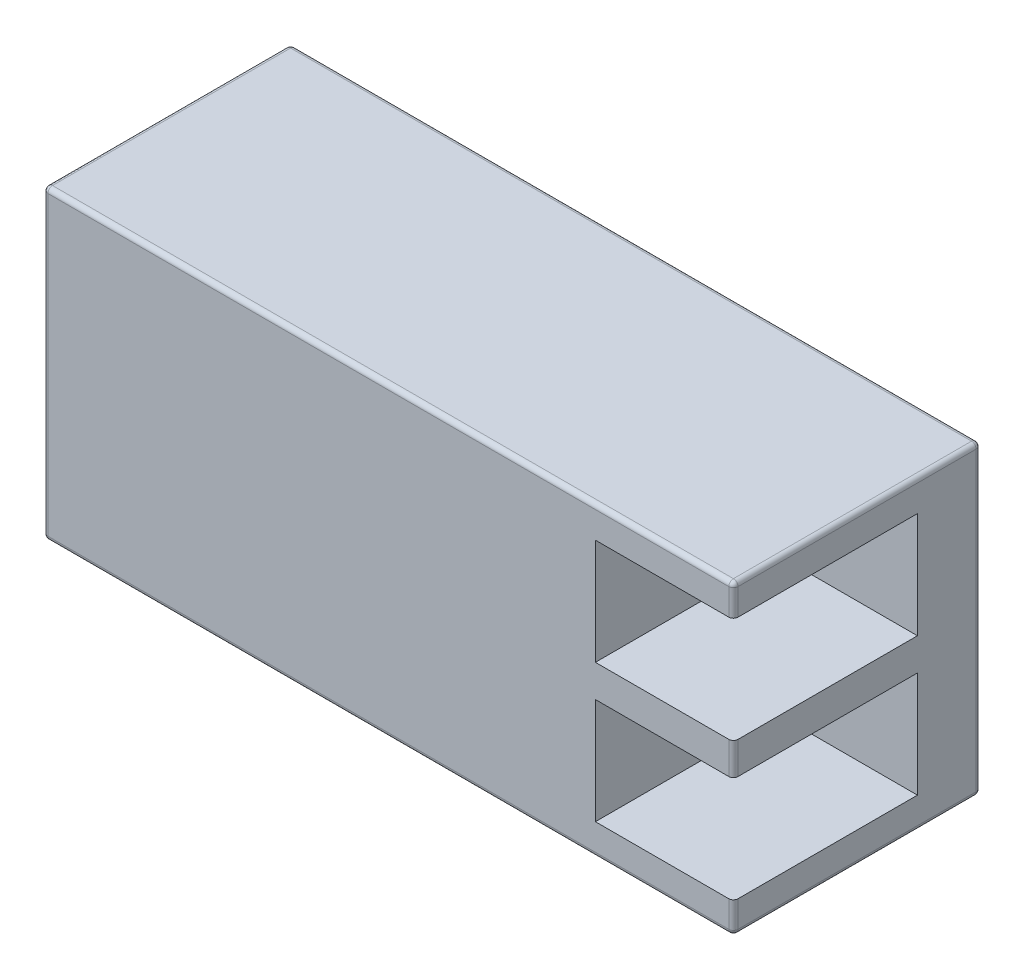
ISO-10303-21;
HEADER;
FILE_DESCRIPTION(('STEP AP214'),'2;1');
FILE_NAME('part.step','',(''),(''),'','','');
FILE_SCHEMA(('AUTOMOTIVE_DESIGN { 1 0 10303 214 1 1 1 1 }'));
ENDSEC;
DATA;
#1=APPLICATION_CONTEXT('core data for automotive mechanical design processes');
#2=APPLICATION_PROTOCOL_DEFINITION('international standard','automotive_design',2000,#1);
#3=PRODUCT_CONTEXT('',#1,'mechanical');
#4=PRODUCT('Part','Part','',(#3));
#5=PRODUCT_RELATED_PRODUCT_CATEGORY('part','',(#4));
#6=PRODUCT_DEFINITION_FORMATION('','',#4);
#7=PRODUCT_DEFINITION_CONTEXT('part definition',#1,'design');
#8=PRODUCT_DEFINITION('design','',#6,#7);
#9=PRODUCT_DEFINITION_SHAPE('','',#8);
#10=(LENGTH_UNIT() NAMED_UNIT(*) SI_UNIT(.MILLI.,.METRE.));
#11=(NAMED_UNIT(*) PLANE_ANGLE_UNIT() SI_UNIT($,.RADIAN.));
#12=(NAMED_UNIT(*) SI_UNIT($,.STERADIAN.) SOLID_ANGLE_UNIT());
#13=UNCERTAINTY_MEASURE_WITH_UNIT(LENGTH_MEASURE(1.E-05),#10,'distance_accuracy_value','');
#14=(GEOMETRIC_REPRESENTATION_CONTEXT(3) GLOBAL_UNCERTAINTY_ASSIGNED_CONTEXT((#13)) GLOBAL_UNIT_ASSIGNED_CONTEXT((#10,
#11,#12)) REPRESENTATION_CONTEXT('',''));
#15=CARTESIAN_POINT('',(0.,0.,0.));
#16=DIRECTION('',(0.,0.,1.));
#17=DIRECTION('',(1.,0.,0.));
#18=AXIS2_PLACEMENT_3D('',#15,#16,#17);
#19=CARTESIAN_POINT('',(15.,6.65,10.75));
#20=DIRECTION('',(-1.,0.,0.));
#21=DIRECTION('',(0.,0.,1.));
#22=AXIS2_PLACEMENT_3D('',#19,#20,#21);
#23=PLANE('',#22);
#24=DIRECTION('',(0.,0.,-1.));
#25=VECTOR('',#24,1.);
#26=CARTESIAN_POINT('',(15.,0.699999999999995,10.75));
#27=LINE('',#26,#25);
#28=CARTESIAN_POINT('',(15.,0.699999999999995,10.55));
#29=VERTEX_POINT('',#28);
#30=CARTESIAN_POINT('',(15.,0.699999999999995,2.75));
#31=VERTEX_POINT('',#30);
#32=EDGE_CURVE('E236',#29,#31,#27,.T.);
#33=ORIENTED_EDGE('',*,*,#32,.F.);
#34=DIRECTION('',(0.,1.,0.));
#35=VECTOR('',#34,1.);
#36=CARTESIAN_POINT('',(15.,6.65,10.55));
#37=LINE('',#36,#35);
#38=CARTESIAN_POINT('',(15.,-0.7,10.55));
#39=VERTEX_POINT('',#38);
#40=EDGE_CURVE('E277',#29,#39,#37,.F.);
#41=ORIENTED_EDGE('',*,*,#40,.T.);
#42=DIRECTION('',(0.,0.,1.));
#43=VECTOR('',#42,1.);
#44=CARTESIAN_POINT('',(15.,-0.7,10.75));
#45=LINE('',#44,#43);
#46=CARTESIAN_POINT('',(15.,-0.7,2.75));
#47=VERTEX_POINT('',#46);
#48=EDGE_CURVE('E208',#47,#39,#45,.T.);
#49=ORIENTED_EDGE('',*,*,#48,.F.);
#50=DIRECTION('',(0.,1.,0.));
#51=VECTOR('',#50,1.);
#52=CARTESIAN_POINT('',(15.,-0.7,2.75));
#53=LINE('',#52,#51);
#54=CARTESIAN_POINT('',(15.,-5.3,2.75));
#55=VERTEX_POINT('',#54);
#56=EDGE_CURVE('E397',#55,#47,#53,.T.);
#57=ORIENTED_EDGE('',*,*,#56,.F.);
#58=DIRECTION('',(0.,0.,-1.));
#59=VECTOR('',#58,1.);
#60=CARTESIAN_POINT('',(15.,-5.3,10.75));
#61=LINE('',#60,#59);
#62=CARTESIAN_POINT('',(15.,-5.3,10.55));
#63=VERTEX_POINT('',#62);
#64=EDGE_CURVE('E238',#63,#55,#61,.T.);
#65=ORIENTED_EDGE('',*,*,#64,.F.);
#66=DIRECTION('',(0.,1.,0.));
#67=VECTOR('',#66,1.);
#68=CARTESIAN_POINT('',(15.,6.65,10.55));
#69=LINE('',#68,#67);
#70=CARTESIAN_POINT('',(15.,-6.45,10.55));
#71=VERTEX_POINT('',#70);
#72=EDGE_CURVE('E275',#63,#71,#69,.F.);
#73=ORIENTED_EDGE('',*,*,#72,.T.);
#74=DIRECTION('',(0.,0.,-1.));
#75=VECTOR('',#74,1.);
#76=CARTESIAN_POINT('',(15.,-6.45,10.75));
#77=LINE('',#76,#75);
#78=CARTESIAN_POINT('',(15.,-6.45,0.200000000000001));
#79=VERTEX_POINT('',#78);
#80=EDGE_CURVE('E266',#71,#79,#77,.T.);
#81=ORIENTED_EDGE('',*,*,#80,.T.);
#82=DIRECTION('',(0.,1.,0.));
#83=VECTOR('',#82,1.);
#84=CARTESIAN_POINT('',(15.,6.65,0.200000000000001));
#85=LINE('',#84,#83);
#86=CARTESIAN_POINT('',(15.,6.45,0.200000000000001));
#87=VERTEX_POINT('',#86);
#88=EDGE_CURVE('E268',#79,#87,#85,.T.);
#89=ORIENTED_EDGE('',*,*,#88,.T.);
#90=DIRECTION('',(0.,0.,-1.));
#91=VECTOR('',#90,1.);
#92=CARTESIAN_POINT('',(15.,6.45,10.75));
#93=LINE('',#92,#91);
#94=CARTESIAN_POINT('',(15.,6.45,10.55));
#95=VERTEX_POINT('',#94);
#96=EDGE_CURVE('E269',#87,#95,#93,.F.);
#97=ORIENTED_EDGE('',*,*,#96,.T.);
#98=DIRECTION('',(0.,1.,0.));
#99=VECTOR('',#98,1.);
#100=CARTESIAN_POINT('',(15.,6.65,10.55));
#101=LINE('',#100,#99);
#102=CARTESIAN_POINT('',(15.,5.29999999999999,10.55));
#103=VERTEX_POINT('',#102);
#104=EDGE_CURVE('E273',#95,#103,#101,.F.);
#105=ORIENTED_EDGE('',*,*,#104,.T.);
#106=DIRECTION('',(0.,0.,1.));
#107=VECTOR('',#106,1.);
#108=CARTESIAN_POINT('',(15.,5.29999999999999,10.75));
#109=LINE('',#108,#107);
#110=CARTESIAN_POINT('',(15.,5.29999999999999,2.75));
#111=VERTEX_POINT('',#110);
#112=EDGE_CURVE('E231',#111,#103,#109,.T.);
#113=ORIENTED_EDGE('',*,*,#112,.F.);
#114=DIRECTION('',(0.,1.,0.));
#115=VECTOR('',#114,1.);
#116=CARTESIAN_POINT('',(15.,0.699999999999995,2.75));
#117=LINE('',#116,#115);
#118=EDGE_CURVE('E233',#31,#111,#117,.T.);
#119=ORIENTED_EDGE('',*,*,#118,.F.);
#120=EDGE_LOOP('',(#33,#41,#49,#57,#65,#73,#81,#89,#97,#105,#113,#119));
#121=FACE_BOUND('',#120,.T.);
#122=ADVANCED_FACE('F39',(#121),#23,.F.);
#123=CARTESIAN_POINT('',(-15.,6.65,10.75));
#124=DIRECTION('',(1.,0.,0.));
#125=DIRECTION('',(0.,0.,-1.));
#126=AXIS2_PLACEMENT_3D('',#123,#124,#125);
#127=PLANE('',#126);
#128=DIRECTION('',(0.,-1.,0.));
#129=VECTOR('',#128,1.);
#130=CARTESIAN_POINT('',(-15.,-6.65,0.200000000000001));
#131=LINE('',#130,#129);
#132=CARTESIAN_POINT('',(-15.,6.45,0.200000000000001));
#133=VERTEX_POINT('',#132);
#134=CARTESIAN_POINT('',(-15.,-6.45000000000001,0.200000000000001));
#135=VERTEX_POINT('',#134);
#136=EDGE_CURVE('E299',#133,#135,#131,.T.);
#137=ORIENTED_EDGE('',*,*,#136,.T.);
#138=DIRECTION('',(0.,0.,-1.));
#139=VECTOR('',#138,1.);
#140=CARTESIAN_POINT('',(-15.,-6.45000000000001,10.75));
#141=LINE('',#140,#139);
#142=CARTESIAN_POINT('',(-15.,-6.45000000000001,10.55));
#143=VERTEX_POINT('',#142);
#144=EDGE_CURVE('E300',#135,#143,#141,.F.);
#145=ORIENTED_EDGE('',*,*,#144,.T.);
#146=DIRECTION('',(0.,-1.,0.));
#147=VECTOR('',#146,1.);
#148=CARTESIAN_POINT('',(-15.,6.65,10.55));
#149=LINE('',#148,#147);
#150=CARTESIAN_POINT('',(-15.,6.45,10.55));
#151=VERTEX_POINT('',#150);
#152=EDGE_CURVE('E291',#143,#151,#149,.F.);
#153=ORIENTED_EDGE('',*,*,#152,.T.);
#154=DIRECTION('',(0.,0.,-1.));
#155=VECTOR('',#154,1.);
#156=CARTESIAN_POINT('',(-15.,6.45,10.75));
#157=LINE('',#156,#155);
#158=EDGE_CURVE('E293',#151,#133,#157,.T.);
#159=ORIENTED_EDGE('',*,*,#158,.T.);
#160=EDGE_LOOP('',(#137,#145,#153,#159));
#161=FACE_BOUND('',#160,.T.);
#162=ADVANCED_FACE('F487',(#161),#127,.F.);
#163=CARTESIAN_POINT('',(15.,-6.65,10.75));
#164=DIRECTION('',(0.,1.,0.));
#165=DIRECTION('',(-1.,0.,0.));
#166=AXIS2_PLACEMENT_3D('',#163,#164,#165);
#167=PLANE('',#166);
#168=DIRECTION('',(1.,0.,0.));
#169=VECTOR('',#168,1.);
#170=CARTESIAN_POINT('',(15.,-6.65,10.55));
#171=LINE('',#170,#169);
#172=CARTESIAN_POINT('',(14.8,-6.65,10.55));
#173=VERTEX_POINT('',#172);
#174=CARTESIAN_POINT('',(-14.8,-6.65,10.55));
#175=VERTEX_POINT('',#174);
#176=EDGE_CURVE('E285',#173,#175,#171,.F.);
#177=ORIENTED_EDGE('',*,*,#176,.T.);
#178=DIRECTION('',(0.,0.,-1.));
#179=VECTOR('',#178,1.);
#180=CARTESIAN_POINT('',(-14.8,-6.65,10.75));
#181=LINE('',#180,#179);
#182=CARTESIAN_POINT('',(-14.8,-6.65,0.200000000000001));
#183=VERTEX_POINT('',#182);
#184=EDGE_CURVE('E289',#175,#183,#181,.T.);
#185=ORIENTED_EDGE('',*,*,#184,.T.);
#186=DIRECTION('',(1.,0.,0.));
#187=VECTOR('',#186,1.);
#188=CARTESIAN_POINT('',(15.,-6.65,0.200000000000001));
#189=LINE('',#188,#187);
#190=CARTESIAN_POINT('',(14.8,-6.65,0.200000000000001));
#191=VERTEX_POINT('',#190);
#192=EDGE_CURVE('E287',#183,#191,#189,.T.);
#193=ORIENTED_EDGE('',*,*,#192,.T.);
#194=DIRECTION('',(0.,0.,-1.));
#195=VECTOR('',#194,1.);
#196=CARTESIAN_POINT('',(14.8,-6.65,10.75));
#197=LINE('',#196,#195);
#198=EDGE_CURVE('E286',#191,#173,#197,.F.);
#199=ORIENTED_EDGE('',*,*,#198,.T.);
#200=EDGE_LOOP('',(#177,#185,#193,#199));
#201=FACE_BOUND('',#200,.T.);
#202=ADVANCED_FACE('F494',(#201),#167,.F.);
#203=CARTESIAN_POINT('',(15.,6.65,10.75));
#204=DIRECTION('',(0.,-1.,0.));
#205=DIRECTION('',(1.,0.,0.));
#206=AXIS2_PLACEMENT_3D('',#203,#204,#205);
#207=PLANE('',#206);
#208=DIRECTION('',(0.,0.,-1.));
#209=VECTOR('',#208,1.);
#210=CARTESIAN_POINT('',(14.8,6.65,10.75));
#211=LINE('',#210,#209);
#212=CARTESIAN_POINT('',(14.8,6.65,10.55));
#213=VERTEX_POINT('',#212);
#214=CARTESIAN_POINT('',(14.8,6.65,0.200000000000001));
#215=VERTEX_POINT('',#214);
#216=EDGE_CURVE('E56',#213,#215,#211,.T.);
#217=ORIENTED_EDGE('',*,*,#216,.T.);
#218=DIRECTION('',(-1.,0.,0.));
#219=VECTOR('',#218,1.);
#220=CARTESIAN_POINT('',(-15.,6.65,0.200000000000001));
#221=LINE('',#220,#219);
#222=CARTESIAN_POINT('',(-14.8,6.65,0.200000000000001));
#223=VERTEX_POINT('',#222);
#224=EDGE_CURVE('E11',#215,#223,#221,.T.);
#225=ORIENTED_EDGE('',*,*,#224,.T.);
#226=DIRECTION('',(0.,0.,-1.));
#227=VECTOR('',#226,1.);
#228=CARTESIAN_POINT('',(-14.8,6.65,10.75));
#229=LINE('',#228,#227);
#230=CARTESIAN_POINT('',(-14.8,6.65,10.55));
#231=VERTEX_POINT('',#230);
#232=EDGE_CURVE('E48',#223,#231,#229,.F.);
#233=ORIENTED_EDGE('',*,*,#232,.T.);
#234=DIRECTION('',(-1.,0.,0.));
#235=VECTOR('',#234,1.);
#236=CARTESIAN_POINT('',(15.,6.65,10.55));
#237=LINE('',#236,#235);
#238=EDGE_CURVE('E313',#231,#213,#237,.F.);
#239=ORIENTED_EDGE('',*,*,#238,.T.);
#240=EDGE_LOOP('',(#217,#225,#233,#239));
#241=FACE_BOUND('',#240,.T.);
#242=ADVANCED_FACE('F451',(#241),#207,.F.);
#243=CARTESIAN_POINT('',(0.,0.,10.75));
#244=DIRECTION('',(0.,0.,-1.));
#245=DIRECTION('',(-1.,0.,0.));
#246=AXIS2_PLACEMENT_3D('',#243,#244,#245);
#247=PLANE('',#246);
#248=DIRECTION('',(1.,0.,0.));
#249=VECTOR('',#248,1.);
#250=CARTESIAN_POINT('',(9.,-0.7,10.75));
#251=LINE('',#250,#249);
#252=CARTESIAN_POINT('',(9.,-0.7,10.75));
#253=VERTEX_POINT('',#252);
#254=CARTESIAN_POINT('',(14.8,-0.7,10.75));
#255=VERTEX_POINT('',#254);
#256=EDGE_CURVE('E251',#253,#255,#251,.T.);
#257=ORIENTED_EDGE('',*,*,#256,.T.);
#258=DIRECTION('',(0.,1.,0.));
#259=VECTOR('',#258,1.);
#260=CARTESIAN_POINT('',(14.8,0.,10.75));
#261=LINE('',#260,#259);
#262=CARTESIAN_POINT('',(14.8,0.699999999999995,10.75));
#263=VERTEX_POINT('',#262);
#264=EDGE_CURVE('E261',#255,#263,#261,.T.);
#265=ORIENTED_EDGE('',*,*,#264,.T.);
#266=DIRECTION('',(1.,0.,0.));
#267=VECTOR('',#266,1.);
#268=CARTESIAN_POINT('',(9.,0.699999999999995,10.75));
#269=LINE('',#268,#267);
#270=CARTESIAN_POINT('',(9.,0.699999999999995,10.75));
#271=VERTEX_POINT('',#270);
#272=EDGE_CURVE('E227',#271,#263,#269,.T.);
#273=ORIENTED_EDGE('',*,*,#272,.F.);
#274=DIRECTION('',(0.,-1.,0.));
#275=VECTOR('',#274,1.);
#276=CARTESIAN_POINT('',(9.,0.699999999999995,10.75));
#277=LINE('',#276,#275);
#278=CARTESIAN_POINT('',(9.,5.29999999999999,10.75));
#279=VERTEX_POINT('',#278);
#280=EDGE_CURVE('E225',#279,#271,#277,.T.);
#281=ORIENTED_EDGE('',*,*,#280,.F.);
#282=DIRECTION('',(1.,0.,0.));
#283=VECTOR('',#282,1.);
#284=CARTESIAN_POINT('',(9.,5.29999999999999,10.75));
#285=LINE('',#284,#283);
#286=CARTESIAN_POINT('',(14.8,5.29999999999999,10.75));
#287=VERTEX_POINT('',#286);
#288=EDGE_CURVE('E223',#279,#287,#285,.T.);
#289=ORIENTED_EDGE('',*,*,#288,.T.);
#290=DIRECTION('',(0.,1.,0.));
#291=VECTOR('',#290,1.);
#292=CARTESIAN_POINT('',(14.8,0.,10.75));
#293=LINE('',#292,#291);
#294=CARTESIAN_POINT('',(14.8,6.45,10.75));
#295=VERTEX_POINT('',#294);
#296=EDGE_CURVE('E256',#287,#295,#293,.T.);
#297=ORIENTED_EDGE('',*,*,#296,.T.);
#298=DIRECTION('',(-1.,0.,0.));
#299=VECTOR('',#298,1.);
#300=CARTESIAN_POINT('',(0.,6.45,10.75));
#301=LINE('',#300,#299);
#302=CARTESIAN_POINT('',(-14.8,6.45,10.75));
#303=VERTEX_POINT('',#302);
#304=EDGE_CURVE('E254',#295,#303,#301,.T.);
#305=ORIENTED_EDGE('',*,*,#304,.T.);
#306=DIRECTION('',(0.,-1.,0.));
#307=VECTOR('',#306,1.);
#308=CARTESIAN_POINT('',(-14.8,0.,10.75));
#309=LINE('',#308,#307);
#310=CARTESIAN_POINT('',(-14.8,-6.45000000000001,10.75));
#311=VERTEX_POINT('',#310);
#312=EDGE_CURVE('E252',#303,#311,#309,.T.);
#313=ORIENTED_EDGE('',*,*,#312,.T.);
#314=DIRECTION('',(1.,0.,0.));
#315=VECTOR('',#314,1.);
#316=CARTESIAN_POINT('',(0.,-6.45,10.75));
#317=LINE('',#316,#315);
#318=CARTESIAN_POINT('',(14.8,-6.45,10.75));
#319=VERTEX_POINT('',#318);
#320=EDGE_CURVE('E249',#311,#319,#317,.T.);
#321=ORIENTED_EDGE('',*,*,#320,.T.);
#322=DIRECTION('',(0.,1.,0.));
#323=VECTOR('',#322,1.);
#324=CARTESIAN_POINT('',(14.8,0.,10.75));
#325=LINE('',#324,#323);
#326=CARTESIAN_POINT('',(14.8,-5.3,10.75));
#327=VERTEX_POINT('',#326);
#328=EDGE_CURVE('E215',#319,#327,#325,.T.);
#329=ORIENTED_EDGE('',*,*,#328,.T.);
#330=DIRECTION('',(1.,0.,0.));
#331=VECTOR('',#330,1.);
#332=CARTESIAN_POINT('',(9.,-5.3,10.75));
#333=LINE('',#332,#331);
#334=CARTESIAN_POINT('',(9.,-5.3,10.75));
#335=VERTEX_POINT('',#334);
#336=EDGE_CURVE('E191',#335,#327,#333,.T.);
#337=ORIENTED_EDGE('',*,*,#336,.F.);
#338=DIRECTION('',(0.,-1.,0.));
#339=VECTOR('',#338,1.);
#340=CARTESIAN_POINT('',(9.,-0.7,10.75));
#341=LINE('',#340,#339);
#342=EDGE_CURVE('E200',#253,#335,#341,.T.);
#343=ORIENTED_EDGE('',*,*,#342,.F.);
#344=EDGE_LOOP('',(#257,#265,#273,#281,#289,#297,#305,#313,#321,#329,#337,#343));
#345=FACE_BOUND('',#344,.T.);
#346=ADVANCED_FACE('F209',(#345),#247,.F.);
#347=CARTESIAN_POINT('',(0.,0.,0.));
#348=DIRECTION('',(0.,0.,-1.));
#349=DIRECTION('',(-1.,0.,0.));
#350=AXIS2_PLACEMENT_3D('',#347,#348,#349);
#351=PLANE('',#350);
#352=DIRECTION('',(1.,0.,0.));
#353=VECTOR('',#352,1.);
#354=CARTESIAN_POINT('',(-15.,-6.45000000000001,0.));
#355=LINE('',#354,#353);
#356=CARTESIAN_POINT('',(14.8,-6.45,0.));
#357=VERTEX_POINT('',#356);
#358=CARTESIAN_POINT('',(-14.8,-6.45000000000001,0.));
#359=VERTEX_POINT('',#358);
#360=EDGE_CURVE('E303',#357,#359,#355,.F.);
#361=ORIENTED_EDGE('',*,*,#360,.T.);
#362=DIRECTION('',(0.,-1.,0.));
#363=VECTOR('',#362,1.);
#364=CARTESIAN_POINT('',(-14.8,6.65,0.));
#365=LINE('',#364,#363);
#366=CARTESIAN_POINT('',(-14.8,6.45,0.));
#367=VERTEX_POINT('',#366);
#368=EDGE_CURVE('E306',#359,#367,#365,.F.);
#369=ORIENTED_EDGE('',*,*,#368,.T.);
#370=DIRECTION('',(-1.,0.,0.));
#371=VECTOR('',#370,1.);
#372=CARTESIAN_POINT('',(15.,6.45,0.));
#373=LINE('',#372,#371);
#374=CARTESIAN_POINT('',(14.8,6.45,0.));
#375=VERTEX_POINT('',#374);
#376=EDGE_CURVE('E308',#367,#375,#373,.F.);
#377=ORIENTED_EDGE('',*,*,#376,.T.);
#378=DIRECTION('',(0.,1.,0.));
#379=VECTOR('',#378,1.);
#380=CARTESIAN_POINT('',(14.8,-6.65,0.));
#381=LINE('',#380,#379);
#382=EDGE_CURVE('E305',#375,#357,#381,.F.);
#383=ORIENTED_EDGE('',*,*,#382,.T.);
#384=EDGE_LOOP('',(#361,#369,#377,#383));
#385=FACE_BOUND('',#384,.T.);
#386=ADVANCED_FACE('F472',(#385),#351,.T.);
#387=CARTESIAN_POINT('',(9.,0.699999999999995,10.75));
#388=DIRECTION('',(0.,-1.,0.));
#389=DIRECTION('',(0.,0.,-1.));
#390=AXIS2_PLACEMENT_3D('',#387,#388,#389);
#391=PLANE('',#390);
#392=ORIENTED_EDGE('',*,*,#272,.T.);
#393=CARTESIAN_POINT('',(14.8,0.699999999999995,10.55));
#394=DIRECTION('',(0.,-1.,0.));
#395=DIRECTION('',(0.,0.,-1.));
#396=AXIS2_PLACEMENT_3D('',#393,#394,#395);
#397=CIRCLE('',#396,0.2);
#398=EDGE_CURVE('E262',#263,#29,#397,.F.);
#399=ORIENTED_EDGE('',*,*,#398,.T.);
#400=ORIENTED_EDGE('',*,*,#32,.T.);
#401=DIRECTION('',(1.,0.,0.));
#402=VECTOR('',#401,1.);
#403=CARTESIAN_POINT('',(9.,0.699999999999995,2.75));
#404=LINE('',#403,#402);
#405=CARTESIAN_POINT('',(9.,0.699999999999995,2.75));
#406=VERTEX_POINT('',#405);
#407=EDGE_CURVE('E218',#406,#31,#404,.T.);
#408=ORIENTED_EDGE('',*,*,#407,.F.);
#409=DIRECTION('',(0.,0.,-1.));
#410=VECTOR('',#409,1.);
#411=CARTESIAN_POINT('',(9.,0.699999999999995,10.75));
#412=LINE('',#411,#410);
#413=EDGE_CURVE('E234',#271,#406,#412,.T.);
#414=ORIENTED_EDGE('',*,*,#413,.F.);
#415=EDGE_LOOP('',(#392,#399,#400,#408,#414));
#416=FACE_BOUND('',#415,.T.);
#417=ADVANCED_FACE('F416',(#416),#391,.F.);
#418=CARTESIAN_POINT('',(9.,5.29999999999999,10.75));
#419=DIRECTION('',(0.,1.,0.));
#420=DIRECTION('',(0.,0.,1.));
#421=AXIS2_PLACEMENT_3D('',#418,#419,#420);
#422=PLANE('',#421);
#423=ORIENTED_EDGE('',*,*,#112,.T.);
#424=CARTESIAN_POINT('',(14.8,5.29999999999999,10.55));
#425=DIRECTION('',(0.,1.,0.));
#426=DIRECTION('',(0.,0.,1.));
#427=AXIS2_PLACEMENT_3D('',#424,#425,#426);
#428=CIRCLE('',#427,0.2);
#429=EDGE_CURVE('E278',#103,#287,#428,.F.);
#430=ORIENTED_EDGE('',*,*,#429,.T.);
#431=ORIENTED_EDGE('',*,*,#288,.F.);
#432=DIRECTION('',(0.,0.,1.));
#433=VECTOR('',#432,1.);
#434=CARTESIAN_POINT('',(9.,5.29999999999999,10.75));
#435=LINE('',#434,#433);
#436=CARTESIAN_POINT('',(9.,5.29999999999999,2.75));
#437=VERTEX_POINT('',#436);
#438=EDGE_CURVE('E242',#437,#279,#435,.T.);
#439=ORIENTED_EDGE('',*,*,#438,.F.);
#440=DIRECTION('',(1.,0.,0.));
#441=VECTOR('',#440,1.);
#442=CARTESIAN_POINT('',(9.,5.29999999999999,2.75));
#443=LINE('',#442,#441);
#444=EDGE_CURVE('E224',#437,#111,#443,.T.);
#445=ORIENTED_EDGE('',*,*,#444,.T.);
#446=EDGE_LOOP('',(#423,#430,#431,#439,#445));
#447=FACE_BOUND('',#446,.T.);
#448=ADVANCED_FACE('F718',(#447),#422,.F.);
#449=CARTESIAN_POINT('',(9.,0.699999999999995,2.75));
#450=DIRECTION('',(0.,0.,-1.));
#451=DIRECTION('',(-1.,0.,0.));
#452=AXIS2_PLACEMENT_3D('',#449,#450,#451);
#453=PLANE('',#452);
#454=ORIENTED_EDGE('',*,*,#118,.T.);
#455=ORIENTED_EDGE('',*,*,#444,.F.);
#456=DIRECTION('',(0.,1.,0.));
#457=VECTOR('',#456,1.);
#458=CARTESIAN_POINT('',(9.,0.699999999999995,2.75));
#459=LINE('',#458,#457);
#460=EDGE_CURVE('E241',#406,#437,#459,.T.);
#461=ORIENTED_EDGE('',*,*,#460,.F.);
#462=ORIENTED_EDGE('',*,*,#407,.T.);
#463=EDGE_LOOP('',(#454,#455,#461,#462));
#464=FACE_BOUND('',#463,.T.);
#465=ADVANCED_FACE('F715',(#464),#453,.F.);
#466=CARTESIAN_POINT('',(9.,0.,0.));
#467=DIRECTION('',(1.,0.,0.));
#468=DIRECTION('',(0.,0.,-1.));
#469=AXIS2_PLACEMENT_3D('',#466,#467,#468);
#470=PLANE('',#469);
#471=ORIENTED_EDGE('',*,*,#413,.T.);
#472=ORIENTED_EDGE('',*,*,#460,.T.);
#473=ORIENTED_EDGE('',*,*,#438,.T.);
#474=ORIENTED_EDGE('',*,*,#280,.T.);
#475=EDGE_LOOP('',(#471,#472,#473,#474));
#476=FACE_BOUND('',#475,.T.);
#477=ADVANCED_FACE('F423',(#476),#470,.T.);
#478=CARTESIAN_POINT('',(9.,-0.7,10.75));
#479=DIRECTION('',(0.,1.,0.));
#480=DIRECTION('',(0.,0.,1.));
#481=AXIS2_PLACEMENT_3D('',#478,#479,#480);
#482=PLANE('',#481);
#483=ORIENTED_EDGE('',*,*,#48,.T.);
#484=CARTESIAN_POINT('',(14.8,-0.7,10.55));
#485=DIRECTION('',(0.,1.,0.));
#486=DIRECTION('',(0.,0.,1.));
#487=AXIS2_PLACEMENT_3D('',#484,#485,#486);
#488=CIRCLE('',#487,0.2);
#489=EDGE_CURVE('E279',#39,#255,#488,.F.);
#490=ORIENTED_EDGE('',*,*,#489,.T.);
#491=ORIENTED_EDGE('',*,*,#256,.F.);
#492=DIRECTION('',(0.,0.,1.));
#493=VECTOR('',#492,1.);
#494=CARTESIAN_POINT('',(9.,-0.7,10.75));
#495=LINE('',#494,#493);
#496=CARTESIAN_POINT('',(9.,-0.7,2.75));
#497=VERTEX_POINT('',#496);
#498=EDGE_CURVE('E204',#497,#253,#495,.T.);
#499=ORIENTED_EDGE('',*,*,#498,.F.);
#500=DIRECTION('',(1.,0.,0.));
#501=VECTOR('',#500,1.);
#502=CARTESIAN_POINT('',(9.,-0.7,2.75));
#503=LINE('',#502,#501);
#504=EDGE_CURVE('E212',#497,#47,#503,.T.);
#505=ORIENTED_EDGE('',*,*,#504,.T.);
#506=EDGE_LOOP('',(#483,#490,#491,#499,#505));
#507=FACE_BOUND('',#506,.T.);
#508=ADVANCED_FACE('F408',(#507),#482,.F.);
#509=CARTESIAN_POINT('',(9.,-0.7,2.75));
#510=DIRECTION('',(0.,0.,-1.));
#511=DIRECTION('',(-1.,0.,0.));
#512=AXIS2_PLACEMENT_3D('',#509,#510,#511);
#513=PLANE('',#512);
#514=ORIENTED_EDGE('',*,*,#56,.T.);
#515=ORIENTED_EDGE('',*,*,#504,.F.);
#516=DIRECTION('',(0.,1.,0.));
#517=VECTOR('',#516,1.);
#518=CARTESIAN_POINT('',(9.,-0.7,2.75));
#519=LINE('',#518,#517);
#520=CARTESIAN_POINT('',(9.,-5.3,2.75));
#521=VERTEX_POINT('',#520);
#522=EDGE_CURVE('E196',#521,#497,#519,.T.);
#523=ORIENTED_EDGE('',*,*,#522,.F.);
#524=DIRECTION('',(1.,0.,0.));
#525=VECTOR('',#524,1.);
#526=CARTESIAN_POINT('',(9.,-5.3,2.75));
#527=LINE('',#526,#525);
#528=EDGE_CURVE('E193',#521,#55,#527,.T.);
#529=ORIENTED_EDGE('',*,*,#528,.T.);
#530=EDGE_LOOP('',(#514,#515,#523,#529));
#531=FACE_BOUND('',#530,.T.);
#532=ADVANCED_FACE('F410',(#531),#513,.F.);
#533=CARTESIAN_POINT('',(9.,-5.3,10.75));
#534=DIRECTION('',(0.,-1.,0.));
#535=DIRECTION('',(0.,0.,-1.));
#536=AXIS2_PLACEMENT_3D('',#533,#534,#535);
#537=PLANE('',#536);
#538=ORIENTED_EDGE('',*,*,#336,.T.);
#539=CARTESIAN_POINT('',(14.8,-5.3,10.55));
#540=DIRECTION('',(0.,-1.,0.));
#541=DIRECTION('',(0.,0.,-1.));
#542=AXIS2_PLACEMENT_3D('',#539,#540,#541);
#543=CIRCLE('',#542,0.2);
#544=EDGE_CURVE('E284',#327,#63,#543,.F.);
#545=ORIENTED_EDGE('',*,*,#544,.T.);
#546=ORIENTED_EDGE('',*,*,#64,.T.);
#547=ORIENTED_EDGE('',*,*,#528,.F.);
#548=DIRECTION('',(0.,0.,-1.));
#549=VECTOR('',#548,1.);
#550=CARTESIAN_POINT('',(9.,-5.3,10.75));
#551=LINE('',#550,#549);
#552=EDGE_CURVE('E189',#335,#521,#551,.T.);
#553=ORIENTED_EDGE('',*,*,#552,.F.);
#554=EDGE_LOOP('',(#538,#545,#546,#547,#553));
#555=FACE_BOUND('',#554,.T.);
#556=ADVANCED_FACE('F190',(#555),#537,.F.);
#557=CARTESIAN_POINT('',(9.,0.,0.));
#558=DIRECTION('',(1.,0.,0.));
#559=DIRECTION('',(0.,0.,-1.));
#560=AXIS2_PLACEMENT_3D('',#557,#558,#559);
#561=PLANE('',#560);
#562=ORIENTED_EDGE('',*,*,#342,.T.);
#563=ORIENTED_EDGE('',*,*,#552,.T.);
#564=ORIENTED_EDGE('',*,*,#522,.T.);
#565=ORIENTED_EDGE('',*,*,#498,.T.);
#566=EDGE_LOOP('',(#562,#563,#564,#565));
#567=FACE_BOUND('',#566,.T.);
#568=ADVANCED_FACE('F205',(#567),#561,.T.);
#569=CARTESIAN_POINT('',(14.8,0.,10.55));
#570=DIRECTION('',(0.,1.,0.));
#571=DIRECTION('',(0.,0.,1.));
#572=AXIS2_PLACEMENT_3D('',#569,#570,#571);
#573=CYLINDRICAL_SURFACE('',#572,0.2);
#574=ORIENTED_EDGE('',*,*,#489,.F.);
#575=ORIENTED_EDGE('',*,*,#40,.F.);
#576=ORIENTED_EDGE('',*,*,#398,.F.);
#577=ORIENTED_EDGE('',*,*,#264,.F.);
#578=EDGE_LOOP('',(#574,#575,#576,#577));
#579=FACE_BOUND('',#578,.T.);
#580=ADVANCED_FACE('F412',(#579),#573,.T.);
#581=CARTESIAN_POINT('',(-14.8,-6.45000000000001,0.2));
#582=DIRECTION('',(-1.,0.,0.));
#583=DIRECTION('',(0.,0.,1.));
#584=AXIS2_PLACEMENT_3D('',#581,#582,#583);
#585=SPHERICAL_SURFACE('',#584,0.2);
#586=CARTESIAN_POINT('',(-14.8,-6.45000000000001,0.2));
#587=DIRECTION('',(-1.,0.,0.));
#588=DIRECTION('',(0.,0.,1.));
#589=AXIS2_PLACEMENT_3D('',#586,#587,#588);
#590=CIRCLE('',#589,0.2);
#591=EDGE_CURVE('E367',#183,#359,#590,.F.);
#592=ORIENTED_EDGE('',*,*,#591,.F.);
#593=CARTESIAN_POINT('',(-14.8,-6.45000000000001,0.200000000000001));
#594=DIRECTION('',(0.,0.,-1.));
#595=DIRECTION('',(-1.,0.,0.));
#596=AXIS2_PLACEMENT_3D('',#593,#594,#595);
#597=CIRCLE('',#596,0.2);
#598=EDGE_CURVE('E376',#135,#183,#597,.F.);
#599=ORIENTED_EDGE('',*,*,#598,.F.);
#600=CARTESIAN_POINT('',(-14.8,-6.45000000000001,0.200000000000001));
#601=DIRECTION('',(0.,-1.,0.));
#602=DIRECTION('',(0.,0.,-1.));
#603=AXIS2_PLACEMENT_3D('',#600,#601,#602);
#604=CIRCLE('',#603,0.2);
#605=EDGE_CURVE('E373',#359,#135,#604,.F.);
#606=ORIENTED_EDGE('',*,*,#605,.F.);
#607=EDGE_LOOP('',(#592,#599,#606));
#608=FACE_BOUND('',#607,.T.);
#609=ADVANCED_FACE('F485',(#608),#585,.T.);
#610=CARTESIAN_POINT('',(14.8,0.,10.55));
#611=DIRECTION('',(0.,1.,0.));
#612=DIRECTION('',(0.,0.,1.));
#613=AXIS2_PLACEMENT_3D('',#610,#611,#612);
#614=CYLINDRICAL_SURFACE('',#613,0.2);
#615=CARTESIAN_POINT('',(14.8,-6.45,10.55));
#616=DIRECTION('',(0.,-1.,0.));
#617=DIRECTION('',(0.,0.,-1.));
#618=AXIS2_PLACEMENT_3D('',#615,#616,#617);
#619=CIRCLE('',#618,0.2);
#620=EDGE_CURVE('E43',#71,#319,#619,.T.);
#621=ORIENTED_EDGE('',*,*,#620,.F.);
#622=ORIENTED_EDGE('',*,*,#72,.F.);
#623=ORIENTED_EDGE('',*,*,#544,.F.);
#624=ORIENTED_EDGE('',*,*,#328,.F.);
#625=EDGE_LOOP('',(#621,#622,#623,#624));
#626=FACE_BOUND('',#625,.T.);
#627=ADVANCED_FACE('F41',(#626),#614,.T.);
#628=CARTESIAN_POINT('',(14.8,-6.45,10.55));
#629=DIRECTION('',(0.,0.,1.));
#630=DIRECTION('',(1.,0.,0.));
#631=AXIS2_PLACEMENT_3D('',#628,#629,#630);
#632=SPHERICAL_SURFACE('',#631,0.2);
#633=CARTESIAN_POINT('',(14.8,-6.45,10.55));
#634=DIRECTION('',(0.,0.,1.));
#635=DIRECTION('',(1.,0.,0.));
#636=AXIS2_PLACEMENT_3D('',#633,#634,#635);
#637=CIRCLE('',#636,0.2);
#638=EDGE_CURVE('E370',#71,#173,#637,.F.);
#639=ORIENTED_EDGE('',*,*,#638,.F.);
#640=ORIENTED_EDGE('',*,*,#620,.T.);
#641=CARTESIAN_POINT('',(14.8,-6.45,10.55));
#642=DIRECTION('',(1.,0.,0.));
#643=DIRECTION('',(0.,0.,-1.));
#644=AXIS2_PLACEMENT_3D('',#641,#642,#643);
#645=CIRCLE('',#644,0.2);
#646=EDGE_CURVE('E378',#173,#319,#645,.F.);
#647=ORIENTED_EDGE('',*,*,#646,.F.);
#648=EDGE_LOOP('',(#639,#640,#647));
#649=FACE_BOUND('',#648,.T.);
#650=ADVANCED_FACE('F389',(#649),#632,.T.);
#651=CARTESIAN_POINT('',(0.,-6.45,10.55));
#652=DIRECTION('',(1.,0.,0.));
#653=DIRECTION('',(0.,1.,0.));
#654=AXIS2_PLACEMENT_3D('',#651,#652,#653);
#655=CYLINDRICAL_SURFACE('',#654,0.2);
#656=ORIENTED_EDGE('',*,*,#646,.T.);
#657=ORIENTED_EDGE('',*,*,#320,.F.);
#658=CARTESIAN_POINT('',(-14.8,-6.45000000000001,10.55));
#659=DIRECTION('',(-1.,0.,0.));
#660=DIRECTION('',(0.,0.,1.));
#661=AXIS2_PLACEMENT_3D('',#658,#659,#660);
#662=CIRCLE('',#661,0.2);
#663=EDGE_CURVE('E365',#175,#311,#662,.T.);
#664=ORIENTED_EDGE('',*,*,#663,.F.);
#665=ORIENTED_EDGE('',*,*,#176,.F.);
#666=EDGE_LOOP('',(#656,#657,#664,#665));
#667=FACE_BOUND('',#666,.T.);
#668=ADVANCED_FACE('F492',(#667),#655,.T.);
#669=CARTESIAN_POINT('',(-14.8,-6.45000000000001,10.75));
#670=DIRECTION('',(0.,0.,-1.));
#671=DIRECTION('',(-1.,0.,0.));
#672=AXIS2_PLACEMENT_3D('',#669,#670,#671);
#673=CYLINDRICAL_SURFACE('',#672,0.2);
#674=ORIENTED_EDGE('',*,*,#598,.T.);
#675=ORIENTED_EDGE('',*,*,#184,.F.);
#676=CARTESIAN_POINT('',(-14.8,-6.45000000000001,10.55));
#677=DIRECTION('',(0.,0.,1.));
#678=DIRECTION('',(1.,0.,0.));
#679=AXIS2_PLACEMENT_3D('',#676,#677,#678);
#680=CIRCLE('',#679,0.2);
#681=EDGE_CURVE('E363',#143,#175,#680,.T.);
#682=ORIENTED_EDGE('',*,*,#681,.F.);
#683=ORIENTED_EDGE('',*,*,#144,.F.);
#684=EDGE_LOOP('',(#674,#675,#682,#683));
#685=FACE_BOUND('',#684,.T.);
#686=ADVANCED_FACE('F490',(#685),#673,.T.);
#687=CARTESIAN_POINT('',(-14.8,6.65,0.200000000000001));
#688=DIRECTION('',(0.,1.,0.));
#689=DIRECTION('',(0.,0.,1.));
#690=AXIS2_PLACEMENT_3D('',#687,#688,#689);
#691=CYLINDRICAL_SURFACE('',#690,0.2);
#692=ORIENTED_EDGE('',*,*,#605,.T.);
#693=ORIENTED_EDGE('',*,*,#136,.F.);
#694=CARTESIAN_POINT('',(-14.8,6.45,0.2));
#695=DIRECTION('',(0.,1.,0.));
#696=DIRECTION('',(0.,0.,1.));
#697=AXIS2_PLACEMENT_3D('',#694,#695,#696);
#698=CIRCLE('',#697,0.2);
#699=EDGE_CURVE('E357',#367,#133,#698,.T.);
#700=ORIENTED_EDGE('',*,*,#699,.F.);
#701=ORIENTED_EDGE('',*,*,#368,.F.);
#702=EDGE_LOOP('',(#692,#693,#700,#701));
#703=FACE_BOUND('',#702,.T.);
#704=ADVANCED_FACE('F469',(#703),#691,.T.);
#705=CARTESIAN_POINT('',(15.,-6.45,0.200000000000001));
#706=DIRECTION('',(-1.,0.,0.));
#707=DIRECTION('',(0.,-1.,0.));
#708=AXIS2_PLACEMENT_3D('',#705,#706,#707);
#709=CYLINDRICAL_SURFACE('',#708,0.2);
#710=ORIENTED_EDGE('',*,*,#591,.T.);
#711=ORIENTED_EDGE('',*,*,#360,.F.);
#712=CARTESIAN_POINT('',(14.8,-6.45,0.200000000000001));
#713=DIRECTION('',(1.,0.,0.));
#714=DIRECTION('',(0.,0.,-1.));
#715=AXIS2_PLACEMENT_3D('',#712,#713,#714);
#716=CIRCLE('',#715,0.2);
#717=EDGE_CURVE('E351',#191,#357,#716,.T.);
#718=ORIENTED_EDGE('',*,*,#717,.F.);
#719=ORIENTED_EDGE('',*,*,#192,.F.);
#720=EDGE_LOOP('',(#710,#711,#718,#719));
#721=FACE_BOUND('',#720,.T.);
#722=ADVANCED_FACE('F479',(#721),#709,.T.);
#723=CARTESIAN_POINT('',(14.8,-6.45,10.75));
#724=DIRECTION('',(0.,0.,-1.));
#725=DIRECTION('',(-1.,0.,0.));
#726=AXIS2_PLACEMENT_3D('',#723,#724,#725);
#727=CYLINDRICAL_SURFACE('',#726,0.2);
#728=ORIENTED_EDGE('',*,*,#638,.T.);
#729=ORIENTED_EDGE('',*,*,#198,.F.);
#730=CARTESIAN_POINT('',(14.8,-6.45,0.200000000000001));
#731=DIRECTION('',(0.,0.,-1.));
#732=DIRECTION('',(-1.,0.,0.));
#733=AXIS2_PLACEMENT_3D('',#730,#731,#732);
#734=CIRCLE('',#733,0.2);
#735=EDGE_CURVE('E354',#79,#191,#734,.T.);
#736=ORIENTED_EDGE('',*,*,#735,.F.);
#737=ORIENTED_EDGE('',*,*,#80,.F.);
#738=EDGE_LOOP('',(#728,#729,#736,#737));
#739=FACE_BOUND('',#738,.T.);
#740=ADVANCED_FACE('F496',(#739),#727,.T.);
#741=CARTESIAN_POINT('',(-14.8,-6.45000000000001,10.55));
#742=DIRECTION('',(0.,-1.,0.));
#743=DIRECTION('',(0.,0.,-1.));
#744=AXIS2_PLACEMENT_3D('',#741,#742,#743);
#745=SPHERICAL_SURFACE('',#744,0.2);
#746=ORIENTED_EDGE('',*,*,#681,.T.);
#747=ORIENTED_EDGE('',*,*,#663,.T.);
#748=CARTESIAN_POINT('',(-14.8,-6.45000000000001,10.55));
#749=DIRECTION('',(0.,-1.,0.));
#750=DIRECTION('',(0.,0.,-1.));
#751=AXIS2_PLACEMENT_3D('',#748,#749,#750);
#752=CIRCLE('',#751,0.2);
#753=EDGE_CURVE('E349',#143,#311,#752,.F.);
#754=ORIENTED_EDGE('',*,*,#753,.F.);
#755=EDGE_LOOP('',(#746,#747,#754));
#756=FACE_BOUND('',#755,.T.);
#757=ADVANCED_FACE('F491',(#756),#745,.T.);
#758=CARTESIAN_POINT('',(-14.8,6.45,0.2));
#759=DIRECTION('',(-1.,0.,0.));
#760=DIRECTION('',(0.,0.,1.));
#761=AXIS2_PLACEMENT_3D('',#758,#759,#760);
#762=SPHERICAL_SURFACE('',#761,0.2);
#763=CARTESIAN_POINT('',(-14.8,6.45,0.200000000000001));
#764=DIRECTION('',(-1.,0.,0.));
#765=DIRECTION('',(0.,0.,1.));
#766=AXIS2_PLACEMENT_3D('',#763,#764,#765);
#767=CIRCLE('',#766,0.2);
#768=EDGE_CURVE('E343',#367,#223,#767,.F.);
#769=ORIENTED_EDGE('',*,*,#768,.F.);
#770=ORIENTED_EDGE('',*,*,#699,.T.);
#771=CARTESIAN_POINT('',(-14.8,6.45,0.200000000000001));
#772=DIRECTION('',(0.,0.,-1.));
#773=DIRECTION('',(-1.,0.,0.));
#774=AXIS2_PLACEMENT_3D('',#771,#772,#773);
#775=CIRCLE('',#774,0.2);
#776=EDGE_CURVE('E347',#223,#133,#775,.F.);
#777=ORIENTED_EDGE('',*,*,#776,.F.);
#778=EDGE_LOOP('',(#769,#770,#777));
#779=FACE_BOUND('',#778,.T.);
#780=ADVANCED_FACE('F466',(#779),#762,.T.);
#781=CARTESIAN_POINT('',(14.8,-6.45,0.2));
#782=DIRECTION('',(0.,-1.,0.));
#783=DIRECTION('',(0.,0.,-1.));
#784=AXIS2_PLACEMENT_3D('',#781,#782,#783);
#785=SPHERICAL_SURFACE('',#784,0.2);
#786=ORIENTED_EDGE('',*,*,#735,.T.);
#787=ORIENTED_EDGE('',*,*,#717,.T.);
#788=CARTESIAN_POINT('',(14.8,-6.45,0.2));
#789=DIRECTION('',(0.,-1.,0.));
#790=DIRECTION('',(1.,0.,0.));
#791=AXIS2_PLACEMENT_3D('',#788,#789,#790);
#792=CIRCLE('',#791,0.2);
#793=EDGE_CURVE('E341',#79,#357,#792,.F.);
#794=ORIENTED_EDGE('',*,*,#793,.F.);
#795=EDGE_LOOP('',(#786,#787,#794));
#796=FACE_BOUND('',#795,.T.);
#797=ADVANCED_FACE('F501',(#796),#785,.T.);
#798=CARTESIAN_POINT('',(-14.8,0.,10.55));
#799=DIRECTION('',(0.,-1.,0.));
#800=DIRECTION('',(0.,0.,-1.));
#801=AXIS2_PLACEMENT_3D('',#798,#799,#800);
#802=CYLINDRICAL_SURFACE('',#801,0.2);
#803=ORIENTED_EDGE('',*,*,#753,.T.);
#804=ORIENTED_EDGE('',*,*,#312,.F.);
#805=CARTESIAN_POINT('',(-14.8,6.45,10.55));
#806=DIRECTION('',(0.,1.,0.));
#807=DIRECTION('',(0.,0.,1.));
#808=AXIS2_PLACEMENT_3D('',#805,#806,#807);
#809=CIRCLE('',#808,0.2);
#810=EDGE_CURVE('E337',#151,#303,#809,.T.);
#811=ORIENTED_EDGE('',*,*,#810,.F.);
#812=ORIENTED_EDGE('',*,*,#152,.F.);
#813=EDGE_LOOP('',(#803,#804,#811,#812));
#814=FACE_BOUND('',#813,.T.);
#815=ADVANCED_FACE('F445',(#814),#802,.T.);
#816=CARTESIAN_POINT('',(-14.8,6.45,10.75));
#817=DIRECTION('',(0.,0.,-1.));
#818=DIRECTION('',(-1.,0.,0.));
#819=AXIS2_PLACEMENT_3D('',#816,#817,#818);
#820=CYLINDRICAL_SURFACE('',#819,0.2);
#821=ORIENTED_EDGE('',*,*,#776,.T.);
#822=ORIENTED_EDGE('',*,*,#158,.F.);
#823=CARTESIAN_POINT('',(-14.8,6.45,10.55));
#824=DIRECTION('',(0.,0.,1.));
#825=DIRECTION('',(1.,0.,0.));
#826=AXIS2_PLACEMENT_3D('',#823,#824,#825);
#827=CIRCLE('',#826,0.2);
#828=EDGE_CURVE('E333',#231,#151,#827,.T.);
#829=ORIENTED_EDGE('',*,*,#828,.F.);
#830=ORIENTED_EDGE('',*,*,#232,.F.);
#831=EDGE_LOOP('',(#821,#822,#829,#830));
#832=FACE_BOUND('',#831,.T.);
#833=ADVANCED_FACE('F446',(#832),#820,.T.);
#834=CARTESIAN_POINT('',(15.,6.45,0.200000000000001));
#835=DIRECTION('',(1.,0.,0.));
#836=DIRECTION('',(0.,1.,0.));
#837=AXIS2_PLACEMENT_3D('',#834,#835,#836);
#838=CYLINDRICAL_SURFACE('',#837,0.2);
#839=ORIENTED_EDGE('',*,*,#768,.T.);
#840=ORIENTED_EDGE('',*,*,#224,.F.);
#841=CARTESIAN_POINT('',(14.8,6.45,0.2));
#842=DIRECTION('',(1.,0.,0.));
#843=DIRECTION('',(0.,0.,-1.));
#844=AXIS2_PLACEMENT_3D('',#841,#842,#843);
#845=CIRCLE('',#844,0.2);
#846=EDGE_CURVE('E335',#375,#215,#845,.T.);
#847=ORIENTED_EDGE('',*,*,#846,.F.);
#848=ORIENTED_EDGE('',*,*,#376,.F.);
#849=EDGE_LOOP('',(#839,#840,#847,#848));
#850=FACE_BOUND('',#849,.T.);
#851=ADVANCED_FACE('F463',(#850),#838,.T.);
#852=CARTESIAN_POINT('',(14.8,6.65,0.200000000000001));
#853=DIRECTION('',(0.,-1.,0.));
#854=DIRECTION('',(0.,0.,-1.));
#855=AXIS2_PLACEMENT_3D('',#852,#853,#854);
#856=CYLINDRICAL_SURFACE('',#855,0.2);
#857=ORIENTED_EDGE('',*,*,#793,.T.);
#858=ORIENTED_EDGE('',*,*,#382,.F.);
#859=CARTESIAN_POINT('',(14.8,6.45,0.200000000000001));
#860=DIRECTION('',(0.,1.,0.));
#861=DIRECTION('',(0.,0.,1.));
#862=AXIS2_PLACEMENT_3D('',#859,#860,#861);
#863=CIRCLE('',#862,0.2);
#864=EDGE_CURVE('E328',#87,#375,#863,.T.);
#865=ORIENTED_EDGE('',*,*,#864,.F.);
#866=ORIENTED_EDGE('',*,*,#88,.F.);
#867=EDGE_LOOP('',(#857,#858,#865,#866));
#868=FACE_BOUND('',#867,.T.);
#869=ADVANCED_FACE('F502',(#868),#856,.T.);
#870=CARTESIAN_POINT('',(-14.8,6.45,10.55));
#871=DIRECTION('',(-1.,0.,0.));
#872=DIRECTION('',(0.,0.,1.));
#873=AXIS2_PLACEMENT_3D('',#870,#871,#872);
#874=SPHERICAL_SURFACE('',#873,0.2);
#875=ORIENTED_EDGE('',*,*,#828,.T.);
#876=ORIENTED_EDGE('',*,*,#810,.T.);
#877=CARTESIAN_POINT('',(-14.8,6.45,10.55));
#878=DIRECTION('',(-1.,0.,0.));
#879=DIRECTION('',(0.,0.,1.));
#880=AXIS2_PLACEMENT_3D('',#877,#878,#879);
#881=CIRCLE('',#880,0.2);
#882=EDGE_CURVE('E326',#231,#303,#881,.F.);
#883=ORIENTED_EDGE('',*,*,#882,.F.);
#884=EDGE_LOOP('',(#875,#876,#883));
#885=FACE_BOUND('',#884,.T.);
#886=ADVANCED_FACE('F443',(#885),#874,.T.);
#887=CARTESIAN_POINT('',(14.8,6.45,0.2));
#888=DIRECTION('',(0.,0.,-1.));
#889=DIRECTION('',(-1.,0.,0.));
#890=AXIS2_PLACEMENT_3D('',#887,#888,#889);
#891=SPHERICAL_SURFACE('',#890,0.2);
#892=ORIENTED_EDGE('',*,*,#864,.T.);
#893=ORIENTED_EDGE('',*,*,#846,.T.);
#894=CARTESIAN_POINT('',(14.8,6.45,0.200000000000001));
#895=DIRECTION('',(0.,0.,-1.));
#896=DIRECTION('',(-1.,0.,0.));
#897=AXIS2_PLACEMENT_3D('',#894,#895,#896);
#898=CIRCLE('',#897,0.2);
#899=EDGE_CURVE('E323',#87,#215,#898,.F.);
#900=ORIENTED_EDGE('',*,*,#899,.F.);
#901=EDGE_LOOP('',(#892,#893,#900));
#902=FACE_BOUND('',#901,.T.);
#903=ADVANCED_FACE('F460',(#902),#891,.T.);
#904=CARTESIAN_POINT('',(0.,6.45,10.55));
#905=DIRECTION('',(-1.,0.,0.));
#906=DIRECTION('',(0.,-1.,0.));
#907=AXIS2_PLACEMENT_3D('',#904,#905,#906);
#908=CYLINDRICAL_SURFACE('',#907,0.2);
#909=ORIENTED_EDGE('',*,*,#882,.T.);
#910=ORIENTED_EDGE('',*,*,#304,.F.);
#911=CARTESIAN_POINT('',(14.8,6.45,10.55));
#912=DIRECTION('',(1.,0.,0.));
#913=DIRECTION('',(0.,0.,-1.));
#914=AXIS2_PLACEMENT_3D('',#911,#912,#913);
#915=CIRCLE('',#914,0.2);
#916=EDGE_CURVE('E319',#213,#295,#915,.T.);
#917=ORIENTED_EDGE('',*,*,#916,.F.);
#918=ORIENTED_EDGE('',*,*,#238,.F.);
#919=EDGE_LOOP('',(#909,#910,#917,#918));
#920=FACE_BOUND('',#919,.T.);
#921=ADVANCED_FACE('F440',(#920),#908,.T.);
#922=CARTESIAN_POINT('',(14.8,6.45,10.75));
#923=DIRECTION('',(0.,0.,-1.));
#924=DIRECTION('',(-1.,0.,0.));
#925=AXIS2_PLACEMENT_3D('',#922,#923,#924);
#926=CYLINDRICAL_SURFACE('',#925,0.2);
#927=ORIENTED_EDGE('',*,*,#899,.T.);
#928=ORIENTED_EDGE('',*,*,#216,.F.);
#929=CARTESIAN_POINT('',(14.8,6.45,10.55));
#930=DIRECTION('',(0.,0.,1.));
#931=DIRECTION('',(1.,0.,0.));
#932=AXIS2_PLACEMENT_3D('',#929,#930,#931);
#933=CIRCLE('',#932,0.2);
#934=EDGE_CURVE('E320',#95,#213,#933,.T.);
#935=ORIENTED_EDGE('',*,*,#934,.F.);
#936=ORIENTED_EDGE('',*,*,#96,.F.);
#937=EDGE_LOOP('',(#927,#928,#935,#936));
#938=FACE_BOUND('',#937,.T.);
#939=ADVANCED_FACE('F452',(#938),#926,.T.);
#940=CARTESIAN_POINT('',(14.8,6.45,10.55));
#941=DIRECTION('',(0.,1.,0.));
#942=DIRECTION('',(0.,0.,1.));
#943=AXIS2_PLACEMENT_3D('',#940,#941,#942);
#944=SPHERICAL_SURFACE('',#943,0.2);
#945=ORIENTED_EDGE('',*,*,#934,.T.);
#946=ORIENTED_EDGE('',*,*,#916,.T.);
#947=CARTESIAN_POINT('',(14.8,6.45,10.55));
#948=DIRECTION('',(0.,1.,0.));
#949=DIRECTION('',(0.,0.,1.));
#950=AXIS2_PLACEMENT_3D('',#947,#948,#949);
#951=CIRCLE('',#950,0.2);
#952=EDGE_CURVE('E312',#95,#295,#951,.F.);
#953=ORIENTED_EDGE('',*,*,#952,.F.);
#954=EDGE_LOOP('',(#945,#946,#953));
#955=FACE_BOUND('',#954,.T.);
#956=ADVANCED_FACE('F432',(#955),#944,.T.);
#957=CARTESIAN_POINT('',(14.8,0.,10.55));
#958=DIRECTION('',(0.,1.,0.));
#959=DIRECTION('',(0.,0.,1.));
#960=AXIS2_PLACEMENT_3D('',#957,#958,#959);
#961=CYLINDRICAL_SURFACE('',#960,0.2);
#962=ORIENTED_EDGE('',*,*,#429,.F.);
#963=ORIENTED_EDGE('',*,*,#104,.F.);
#964=ORIENTED_EDGE('',*,*,#952,.T.);
#965=ORIENTED_EDGE('',*,*,#296,.F.);
#966=EDGE_LOOP('',(#962,#963,#964,#965));
#967=FACE_BOUND('',#966,.T.);
#968=ADVANCED_FACE('F428',(#967),#961,.T.);
#969=CLOSED_SHELL('',(#122,#162,#202,#242,#346,#386,#417,#448,#465,#477,#508,#532,#556,#568,
#580,#609,#627,#650,#668,#686,#704,#722,#740,#757,#780,#797,#815,#833,#851,#869,#886,#903,#921,
#939,#956,#968));
#970=MANIFOLD_SOLID_BREP('B2',#969);
#971=ADVANCED_BREP_SHAPE_REPRESENTATION('',(#18,#970),#14);
#972=SHAPE_DEFINITION_REPRESENTATION(#9,#971);
ENDSEC;
END-ISO-10303-21;
